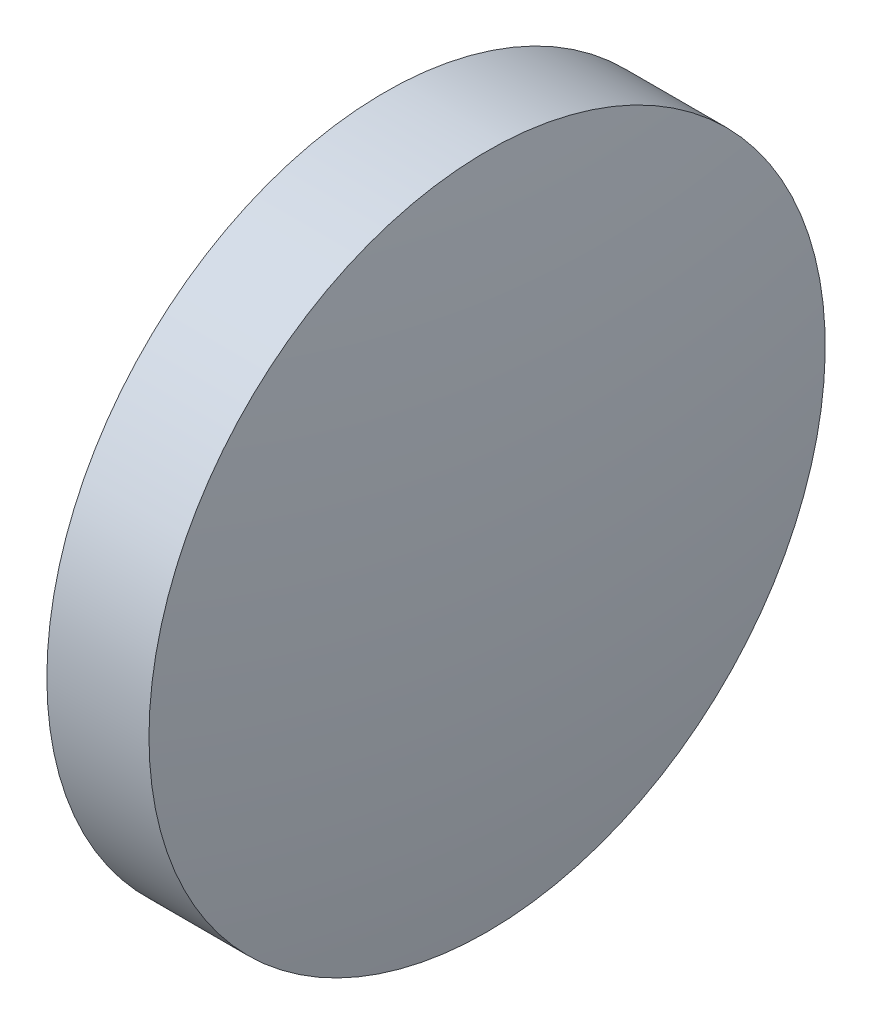
ISO-10303-21;
HEADER;
FILE_DESCRIPTION(('STEP AP214'),'2;1');
FILE_NAME('part.step','',(''),(''),'','','');
FILE_SCHEMA(('AUTOMOTIVE_DESIGN { 1 0 10303 214 1 1 1 1 }'));
ENDSEC;
DATA;
#1=APPLICATION_CONTEXT('core data for automotive mechanical design processes');
#2=APPLICATION_PROTOCOL_DEFINITION('international standard','automotive_design',2000,#1);
#3=PRODUCT_CONTEXT('',#1,'mechanical');
#4=PRODUCT('Part','Part','',(#3));
#5=PRODUCT_RELATED_PRODUCT_CATEGORY('part','',(#4));
#6=PRODUCT_DEFINITION_FORMATION('','',#4);
#7=PRODUCT_DEFINITION_CONTEXT('part definition',#1,'design');
#8=PRODUCT_DEFINITION('design','',#6,#7);
#9=PRODUCT_DEFINITION_SHAPE('','',#8);
#10=(LENGTH_UNIT() NAMED_UNIT(*) SI_UNIT(.MILLI.,.METRE.));
#11=(NAMED_UNIT(*) PLANE_ANGLE_UNIT() SI_UNIT($,.RADIAN.));
#12=(NAMED_UNIT(*) SI_UNIT($,.STERADIAN.) SOLID_ANGLE_UNIT());
#13=UNCERTAINTY_MEASURE_WITH_UNIT(LENGTH_MEASURE(1.E-05),#10,'distance_accuracy_value','');
#14=(GEOMETRIC_REPRESENTATION_CONTEXT(3) GLOBAL_UNCERTAINTY_ASSIGNED_CONTEXT((#13)) GLOBAL_UNIT_ASSIGNED_CONTEXT((#10,
#11,#12)) REPRESENTATION_CONTEXT('',''));
#15=CARTESIAN_POINT('',(0.,0.,0.));
#16=DIRECTION('',(0.,0.,1.));
#17=DIRECTION('',(1.,0.,0.));
#18=AXIS2_PLACEMENT_3D('',#15,#16,#17);
#19=CARTESIAN_POINT('',(565.121486298279,196.241341099847,0.));
#20=DIRECTION('',(-1.,0.,0.));
#21=DIRECTION('',(0.,-1.,0.));
#22=AXIS2_PLACEMENT_3D('',#19,#20,#21);
#23=SPHERICAL_SURFACE('',#22,32.2462820512819);
#24=CARTESIAN_POINT('',(596.977768349561,196.241341099847,0.));
#25=DIRECTION('',(-1.,0.,0.));
#26=DIRECTION('',(0.,0.,1.));
#27=AXIS2_PLACEMENT_3D('',#24,#25,#26);
#28=CIRCLE('',#27,5.);
#29=CARTESIAN_POINT('',(596.977768349561,196.241341099847,5.));
#30=VERTEX_POINT('',#29);
#31=EDGE_CURVE('E10',#30,#30,#28,.T.);
#32=ORIENTED_EDGE('',*,*,#31,.F.);
#33=EDGE_LOOP('',(#32));
#34=FACE_BOUND('',#33,.T.);
#35=ADVANCED_FACE('F35',(#34),#23,.T.);
#36=CARTESIAN_POINT('',(594.526217877787,196.241341099847,0.));
#37=DIRECTION('',(-1.,0.,0.));
#38=DIRECTION('',(0.,0.,1.));
#39=AXIS2_PLACEMENT_3D('',#36,#37,#38);
#40=CYLINDRICAL_SURFACE('',#39,5.);
#41=CARTESIAN_POINT('',(595.467768349561,196.241341099847,0.));
#42=DIRECTION('',(-1.,0.,0.));
#43=DIRECTION('',(0.,0.,1.));
#44=AXIS2_PLACEMENT_3D('',#41,#42,#43);
#45=CIRCLE('',#44,5.);
#46=CARTESIAN_POINT('',(595.467768349561,196.241341099847,5.));
#47=VERTEX_POINT('',#46);
#48=EDGE_CURVE('E41',#47,#47,#45,.T.);
#49=ORIENTED_EDGE('',*,*,#48,.F.);
#50=EDGE_LOOP('',(#49));
#51=FACE_BOUND('',#50,.T.);
#52=ORIENTED_EDGE('',*,*,#31,.T.);
#53=EDGE_LOOP('',(#52));
#54=FACE_BOUND('',#53,.T.);
#55=ADVANCED_FACE('F49',(#51,#54),#40,.T.);
#56=CARTESIAN_POINT('',(595.467768349561,196.241341099847,0.));
#57=DIRECTION('',(1.,0.,0.));
#58=DIRECTION('',(0.,0.,-1.));
#59=AXIS2_PLACEMENT_3D('',#56,#57,#58);
#60=PLANE('',#59);
#61=ORIENTED_EDGE('',*,*,#48,.T.);
#62=EDGE_LOOP('',(#61));
#63=FACE_BOUND('',#62,.T.);
#64=ADVANCED_FACE('F47',(#63),#60,.F.);
#65=CLOSED_SHELL('',(#35,#55,#64));
#66=MANIFOLD_SOLID_BREP('B2',#65);
#67=ADVANCED_BREP_SHAPE_REPRESENTATION('',(#18,#66),#14);
#68=SHAPE_DEFINITION_REPRESENTATION(#9,#67);
ENDSEC;
END-ISO-10303-21;
